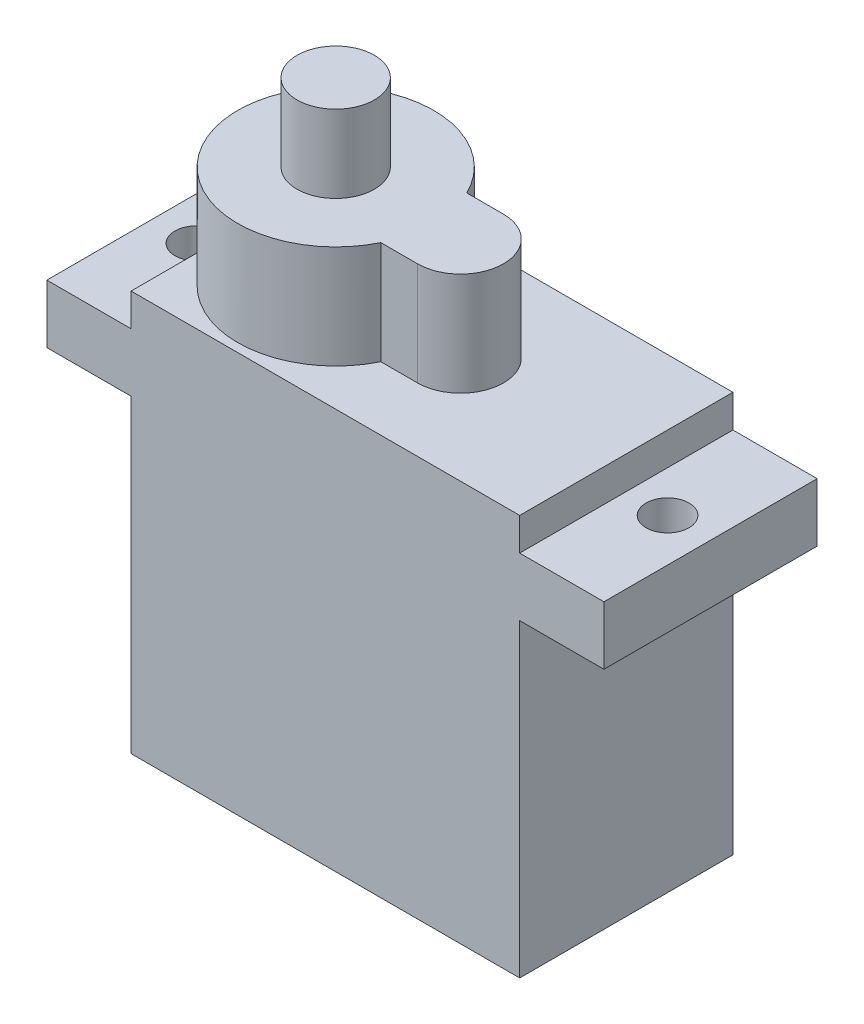
ISO-10303-21;
HEADER;
FILE_DESCRIPTION(('STEP AP214'),'2;1');
FILE_NAME('part.step','',(''),(''),'','','');
FILE_SCHEMA(('AUTOMOTIVE_DESIGN { 1 0 10303 214 1 1 1 1 }'));
ENDSEC;
DATA;
#1=APPLICATION_CONTEXT('core data for automotive mechanical design processes');
#2=APPLICATION_PROTOCOL_DEFINITION('international standard','automotive_design',2000,#1);
#3=PRODUCT_CONTEXT('',#1,'mechanical');
#4=PRODUCT('Part','Part','',(#3));
#5=PRODUCT_RELATED_PRODUCT_CATEGORY('part','',(#4));
#6=PRODUCT_DEFINITION_FORMATION('','',#4);
#7=PRODUCT_DEFINITION_CONTEXT('part definition',#1,'design');
#8=PRODUCT_DEFINITION('design','',#6,#7);
#9=PRODUCT_DEFINITION_SHAPE('','',#8);
#10=(LENGTH_UNIT() NAMED_UNIT(*) SI_UNIT(.MILLI.,.METRE.));
#11=(NAMED_UNIT(*) PLANE_ANGLE_UNIT() SI_UNIT($,.RADIAN.));
#12=(NAMED_UNIT(*) SI_UNIT($,.STERADIAN.) SOLID_ANGLE_UNIT());
#13=UNCERTAINTY_MEASURE_WITH_UNIT(LENGTH_MEASURE(1.E-05),#10,'distance_accuracy_value','');
#14=(GEOMETRIC_REPRESENTATION_CONTEXT(3) GLOBAL_UNCERTAINTY_ASSIGNED_CONTEXT((#13)) GLOBAL_UNIT_ASSIGNED_CONTEXT((#10,
#11,#12)) REPRESENTATION_CONTEXT('',''));
#15=CARTESIAN_POINT('',(0.,0.,0.));
#16=DIRECTION('',(0.,0.,1.));
#17=DIRECTION('',(1.,0.,0.));
#18=AXIS2_PLACEMENT_3D('',#15,#16,#17);
#19=CARTESIAN_POINT('',(-5.6,29.3,0.));
#20=DIRECTION('',(0.,1.,0.));
#21=DIRECTION('',(0.,0.,1.));
#22=AXIS2_PLACEMENT_3D('',#19,#20,#21);
#23=PLANE('',#22);
#24=CARTESIAN_POINT('',(-5.6,29.3,0.));
#25=DIRECTION('',(0.,1.,0.));
#26=DIRECTION('',(0.,0.,1.));
#27=AXIS2_PLACEMENT_3D('',#24,#25,#26);
#28=CIRCLE('',#27,5.7);
#29=CARTESIAN_POINT('',(-0.477500610053719,29.3,-2.5));
#30=VERTEX_POINT('',#29);
#31=CARTESIAN_POINT('',(-0.477500610053719,29.3,2.5));
#32=VERTEX_POINT('',#31);
#33=EDGE_CURVE('E164',#30,#32,#28,.T.);
#34=ORIENTED_EDGE('',*,*,#33,.T.);
#35=DIRECTION('',(1.,0.,0.));
#36=VECTOR('',#35,1.);
#37=CARTESIAN_POINT('',(-0.477500610053719,29.3,2.5));
#38=LINE('',#37,#36);
#39=CARTESIAN_POINT('',(1.6594851256093,29.3,2.5));
#40=VERTEX_POINT('',#39);
#41=EDGE_CURVE('E153',#32,#40,#38,.T.);
#42=ORIENTED_EDGE('',*,*,#41,.T.);
#43=CARTESIAN_POINT('',(1.6594851256093,29.3,0.));
#44=DIRECTION('',(0.,1.,0.));
#45=DIRECTION('',(0.,0.,1.));
#46=AXIS2_PLACEMENT_3D('',#43,#44,#45);
#47=CIRCLE('',#46,2.5);
#48=CARTESIAN_POINT('',(1.6594851256093,29.3,-2.5));
#49=VERTEX_POINT('',#48);
#50=EDGE_CURVE('E163',#40,#49,#47,.T.);
#51=ORIENTED_EDGE('',*,*,#50,.T.);
#52=DIRECTION('',(-1.,0.,0.));
#53=VECTOR('',#52,1.);
#54=CARTESIAN_POINT('',(1.6594851256093,29.3,-2.5));
#55=LINE('',#54,#53);
#56=EDGE_CURVE('E169',#49,#30,#55,.T.);
#57=ORIENTED_EDGE('',*,*,#56,.T.);
#58=EDGE_LOOP('',(#34,#42,#51,#57));
#59=FACE_BOUND('',#58,.T.);
#60=CARTESIAN_POINT('',(-5.6,29.3,0.));
#61=DIRECTION('',(0.,1.,0.));
#62=DIRECTION('',(0.,0.,1.));
#63=AXIS2_PLACEMENT_3D('',#60,#61,#62);
#64=CIRCLE('',#63,2.25);
#65=CARTESIAN_POINT('',(-5.6,29.3,2.25));
#66=VERTEX_POINT('',#65);
#67=EDGE_CURVE('E554',#66,#66,#64,.T.);
#68=ORIENTED_EDGE('',*,*,#67,.F.);
#69=EDGE_LOOP('',(#68));
#70=FACE_BOUND('',#69,.T.);
#71=ADVANCED_FACE('F36',(#59,#70),#23,.T.);
#72=CARTESIAN_POINT('',(0.,21.4,0.));
#73=DIRECTION('',(0.,1.,0.));
#74=DIRECTION('',(0.,0.,1.));
#75=AXIS2_PLACEMENT_3D('',#72,#73,#74);
#76=PLANE('',#75);
#77=DIRECTION('',(0.,0.,-1.));
#78=VECTOR('',#77,1.);
#79=CARTESIAN_POINT('',(11.3,21.4,6.2));
#80=LINE('',#79,#78);
#81=CARTESIAN_POINT('',(11.3,21.4,6.2));
#82=VERTEX_POINT('',#81);
#83=CARTESIAN_POINT('',(11.3,21.4,-6.2));
#84=VERTEX_POINT('',#83);
#85=EDGE_CURVE('E178',#82,#84,#80,.T.);
#86=ORIENTED_EDGE('',*,*,#85,.F.);
#87=DIRECTION('',(1.,0.,0.));
#88=VECTOR('',#87,1.);
#89=CARTESIAN_POINT('',(-16.2,21.4,6.2));
#90=LINE('',#89,#88);
#91=CARTESIAN_POINT('',(16.2,21.4,6.2));
#92=VERTEX_POINT('',#91);
#93=EDGE_CURVE('E202',#82,#92,#90,.T.);
#94=ORIENTED_EDGE('',*,*,#93,.T.);
#95=DIRECTION('',(0.,0.,-1.));
#96=VECTOR('',#95,1.);
#97=CARTESIAN_POINT('',(16.2,21.4,-6.2));
#98=LINE('',#97,#96);
#99=CARTESIAN_POINT('',(16.2,21.4,-6.2));
#100=VERTEX_POINT('',#99);
#101=EDGE_CURVE('E261',#92,#100,#98,.T.);
#102=ORIENTED_EDGE('',*,*,#101,.T.);
#103=DIRECTION('',(-1.,0.,0.));
#104=VECTOR('',#103,1.);
#105=CARTESIAN_POINT('',(-16.2,21.4,-6.2));
#106=LINE('',#105,#104);
#107=EDGE_CURVE('E241',#100,#84,#106,.T.);
#108=ORIENTED_EDGE('',*,*,#107,.T.);
#109=EDGE_LOOP('',(#86,#94,#102,#108));
#110=FACE_BOUND('',#109,.T.);
#111=CARTESIAN_POINT('',(13.7,21.4,0.));
#112=DIRECTION('',(0.,1.,0.));
#113=DIRECTION('',(0.,0.,-1.));
#114=AXIS2_PLACEMENT_3D('',#111,#112,#113);
#115=CIRCLE('',#114,1.25);
#116=CARTESIAN_POINT('',(13.7,21.4,-1.25));
#117=VERTEX_POINT('',#116);
#118=EDGE_CURVE('E374',#117,#117,#115,.T.);
#119=ORIENTED_EDGE('',*,*,#118,.F.);
#120=EDGE_LOOP('',(#119));
#121=FACE_BOUND('',#120,.T.);
#122=ADVANCED_FACE('F379',(#110,#121),#76,.T.);
#123=CARTESIAN_POINT('',(11.3,18.,-6.2));
#124=DIRECTION('',(-1.,0.,0.));
#125=DIRECTION('',(0.,0.,1.));
#126=AXIS2_PLACEMENT_3D('',#123,#124,#125);
#127=PLANE('',#126);
#128=DIRECTION('',(0.,0.,-1.));
#129=VECTOR('',#128,1.);
#130=CARTESIAN_POINT('',(11.3,0.,-6.2));
#131=LINE('',#130,#129);
#132=CARTESIAN_POINT('',(11.3,0.,6.2));
#133=VERTEX_POINT('',#132);
#134=CARTESIAN_POINT('',(11.3,0.,-6.2));
#135=VERTEX_POINT('',#134);
#136=EDGE_CURVE('E289',#133,#135,#131,.T.);
#137=ORIENTED_EDGE('',*,*,#136,.T.);
#138=DIRECTION('',(0.,-1.,0.));
#139=VECTOR('',#138,1.);
#140=CARTESIAN_POINT('',(11.3,18.,-6.2));
#141=LINE('',#140,#139);
#142=CARTESIAN_POINT('',(11.3,18.,-6.2));
#143=VERTEX_POINT('',#142);
#144=EDGE_CURVE('E45',#143,#135,#141,.T.);
#145=ORIENTED_EDGE('',*,*,#144,.F.);
#146=DIRECTION('',(0.,0.,-1.));
#147=VECTOR('',#146,1.);
#148=CARTESIAN_POINT('',(11.3,18.,-6.2));
#149=LINE('',#148,#147);
#150=CARTESIAN_POINT('',(11.3,18.,6.2));
#151=VERTEX_POINT('',#150);
#152=EDGE_CURVE('E275',#151,#143,#149,.T.);
#153=ORIENTED_EDGE('',*,*,#152,.F.);
#154=DIRECTION('',(0.,-1.,0.));
#155=VECTOR('',#154,1.);
#156=CARTESIAN_POINT('',(11.3,18.,6.2));
#157=LINE('',#156,#155);
#158=EDGE_CURVE('E265',#151,#133,#157,.T.);
#159=ORIENTED_EDGE('',*,*,#158,.T.);
#160=EDGE_LOOP('',(#137,#145,#153,#159));
#161=FACE_BOUND('',#160,.T.);
#162=ADVANCED_FACE('F38',(#161),#127,.F.);
#163=CARTESIAN_POINT('',(-11.3,18.,-6.2));
#164=DIRECTION('',(0.,0.,1.));
#165=DIRECTION('',(1.,0.,0.));
#166=AXIS2_PLACEMENT_3D('',#163,#164,#165);
#167=PLANE('',#166);
#168=DIRECTION('',(-1.,0.,0.));
#169=VECTOR('',#168,1.);
#170=CARTESIAN_POINT('',(-11.3,0.,-6.2));
#171=LINE('',#170,#169);
#172=CARTESIAN_POINT('',(-11.3,0.,-6.2));
#173=VERTEX_POINT('',#172);
#174=EDGE_CURVE('E310',#135,#173,#171,.T.);
#175=ORIENTED_EDGE('',*,*,#174,.T.);
#176=DIRECTION('',(0.,-1.,0.));
#177=VECTOR('',#176,1.);
#178=CARTESIAN_POINT('',(-11.3,18.,-6.2));
#179=LINE('',#178,#177);
#180=CARTESIAN_POINT('',(-11.3,18.,-6.2));
#181=VERTEX_POINT('',#180);
#182=EDGE_CURVE('E274',#181,#173,#179,.T.);
#183=ORIENTED_EDGE('',*,*,#182,.F.);
#184=DIRECTION('',(-1.,0.,0.));
#185=VECTOR('',#184,1.);
#186=CARTESIAN_POINT('',(-16.2,18.,-6.2));
#187=LINE('',#186,#185);
#188=CARTESIAN_POINT('',(-16.2,18.,-6.2));
#189=VERTEX_POINT('',#188);
#190=EDGE_CURVE('E285',#181,#189,#187,.T.);
#191=ORIENTED_EDGE('',*,*,#190,.T.);
#192=DIRECTION('',(0.,-1.,0.));
#193=VECTOR('',#192,1.);
#194=CARTESIAN_POINT('',(-16.2,21.4,-6.2));
#195=LINE('',#194,#193);
#196=CARTESIAN_POINT('',(-16.2,21.4,-6.2));
#197=VERTEX_POINT('',#196);
#198=EDGE_CURVE('E317',#197,#189,#195,.T.);
#199=ORIENTED_EDGE('',*,*,#198,.F.);
#200=CARTESIAN_POINT('',(-11.3,21.4,-6.2));
#201=VERTEX_POINT('',#200);
#202=EDGE_CURVE('E249',#201,#197,#106,.T.);
#203=ORIENTED_EDGE('',*,*,#202,.F.);
#204=DIRECTION('',(0.,-1.,0.));
#205=VECTOR('',#204,1.);
#206=CARTESIAN_POINT('',(-11.3,23.3,-6.2));
#207=LINE('',#206,#205);
#208=CARTESIAN_POINT('',(-11.3,23.3,-6.2));
#209=VERTEX_POINT('',#208);
#210=EDGE_CURVE('E208',#209,#201,#207,.T.);
#211=ORIENTED_EDGE('',*,*,#210,.F.);
#212=DIRECTION('',(-1.,0.,0.));
#213=VECTOR('',#212,1.);
#214=CARTESIAN_POINT('',(11.3,23.3,-6.2));
#215=LINE('',#214,#213);
#216=CARTESIAN_POINT('',(11.3,23.3,-6.2));
#217=VERTEX_POINT('',#216);
#218=EDGE_CURVE('E184',#217,#209,#215,.T.);
#219=ORIENTED_EDGE('',*,*,#218,.F.);
#220=DIRECTION('',(0.,-1.,0.));
#221=VECTOR('',#220,1.);
#222=CARTESIAN_POINT('',(11.3,23.3,-6.2));
#223=LINE('',#222,#221);
#224=EDGE_CURVE('E195',#217,#84,#223,.T.);
#225=ORIENTED_EDGE('',*,*,#224,.T.);
#226=ORIENTED_EDGE('',*,*,#107,.F.);
#227=DIRECTION('',(0.,-1.,0.));
#228=VECTOR('',#227,1.);
#229=CARTESIAN_POINT('',(16.2,21.4,-6.2));
#230=LINE('',#229,#228);
#231=CARTESIAN_POINT('',(16.2,18.,-6.2));
#232=VERTEX_POINT('',#231);
#233=EDGE_CURVE('E313',#100,#232,#230,.T.);
#234=ORIENTED_EDGE('',*,*,#233,.T.);
#235=EDGE_CURVE('E354',#232,#143,#187,.T.);
#236=ORIENTED_EDGE('',*,*,#235,.T.);
#237=ORIENTED_EDGE('',*,*,#144,.T.);
#238=EDGE_LOOP('',(#175,#183,#191,#199,#203,#211,#219,#225,#226,#234,#236,#237));
#239=FACE_BOUND('',#238,.T.);
#240=ADVANCED_FACE('F447',(#239),#167,.F.);
#241=CARTESIAN_POINT('',(-11.3,18.,-6.2));
#242=DIRECTION('',(1.,0.,0.));
#243=DIRECTION('',(0.,0.,-1.));
#244=AXIS2_PLACEMENT_3D('',#241,#242,#243);
#245=PLANE('',#244);
#246=DIRECTION('',(0.,0.,1.));
#247=VECTOR('',#246,1.);
#248=CARTESIAN_POINT('',(-11.3,0.,-6.2));
#249=LINE('',#248,#247);
#250=CARTESIAN_POINT('',(-11.3,0.,6.2));
#251=VERTEX_POINT('',#250);
#252=EDGE_CURVE('E308',#173,#251,#249,.T.);
#253=ORIENTED_EDGE('',*,*,#252,.T.);
#254=DIRECTION('',(0.,-1.,0.));
#255=VECTOR('',#254,1.);
#256=CARTESIAN_POINT('',(-11.3,18.,6.2));
#257=LINE('',#256,#255);
#258=CARTESIAN_POINT('',(-11.3,18.,6.2));
#259=VERTEX_POINT('',#258);
#260=EDGE_CURVE('E268',#259,#251,#257,.T.);
#261=ORIENTED_EDGE('',*,*,#260,.F.);
#262=DIRECTION('',(0.,0.,1.));
#263=VECTOR('',#262,1.);
#264=CARTESIAN_POINT('',(-11.3,18.,-6.2));
#265=LINE('',#264,#263);
#266=EDGE_CURVE('E269',#181,#259,#265,.T.);
#267=ORIENTED_EDGE('',*,*,#266,.F.);
#268=ORIENTED_EDGE('',*,*,#182,.T.);
#269=EDGE_LOOP('',(#253,#261,#267,#268));
#270=FACE_BOUND('',#269,.T.);
#271=ADVANCED_FACE('F345',(#270),#245,.F.);
#272=CARTESIAN_POINT('',(-11.3,18.,6.2));
#273=DIRECTION('',(0.,0.,-1.));
#274=DIRECTION('',(-1.,0.,0.));
#275=AXIS2_PLACEMENT_3D('',#272,#273,#274);
#276=PLANE('',#275);
#277=DIRECTION('',(1.,0.,0.));
#278=VECTOR('',#277,1.);
#279=CARTESIAN_POINT('',(-11.3,0.,6.2));
#280=LINE('',#279,#278);
#281=EDGE_CURVE('E279',#251,#133,#280,.T.);
#282=ORIENTED_EDGE('',*,*,#281,.T.);
#283=ORIENTED_EDGE('',*,*,#158,.F.);
#284=DIRECTION('',(1.,0.,0.));
#285=VECTOR('',#284,1.);
#286=CARTESIAN_POINT('',(-16.2,18.,6.2));
#287=LINE('',#286,#285);
#288=CARTESIAN_POINT('',(16.2,18.,6.2));
#289=VERTEX_POINT('',#288);
#290=EDGE_CURVE('E331',#151,#289,#287,.T.);
#291=ORIENTED_EDGE('',*,*,#290,.T.);
#292=DIRECTION('',(0.,-1.,0.));
#293=VECTOR('',#292,1.);
#294=CARTESIAN_POINT('',(16.2,21.4,6.2));
#295=LINE('',#294,#293);
#296=EDGE_CURVE('E234',#92,#289,#295,.T.);
#297=ORIENTED_EDGE('',*,*,#296,.F.);
#298=ORIENTED_EDGE('',*,*,#93,.F.);
#299=DIRECTION('',(0.,-1.,0.));
#300=VECTOR('',#299,1.);
#301=CARTESIAN_POINT('',(11.3,23.3,6.2));
#302=LINE('',#301,#300);
#303=CARTESIAN_POINT('',(11.3,23.3,6.2));
#304=VERTEX_POINT('',#303);
#305=EDGE_CURVE('E209',#304,#82,#302,.T.);
#306=ORIENTED_EDGE('',*,*,#305,.F.);
#307=DIRECTION('',(1.,0.,0.));
#308=VECTOR('',#307,1.);
#309=CARTESIAN_POINT('',(-11.3,23.3,6.2));
#310=LINE('',#309,#308);
#311=CARTESIAN_POINT('',(-11.3,23.3,6.2));
#312=VERTEX_POINT('',#311);
#313=EDGE_CURVE('E191',#312,#304,#310,.T.);
#314=ORIENTED_EDGE('',*,*,#313,.F.);
#315=DIRECTION('',(0.,-1.,0.));
#316=VECTOR('',#315,1.);
#317=CARTESIAN_POINT('',(-11.3,23.3,6.2));
#318=LINE('',#317,#316);
#319=CARTESIAN_POINT('',(-11.3,21.4,6.2));
#320=VERTEX_POINT('',#319);
#321=EDGE_CURVE('E205',#312,#320,#318,.T.);
#322=ORIENTED_EDGE('',*,*,#321,.T.);
#323=CARTESIAN_POINT('',(-16.2,21.4,6.2));
#324=VERTEX_POINT('',#323);
#325=EDGE_CURVE('E238',#324,#320,#90,.T.);
#326=ORIENTED_EDGE('',*,*,#325,.F.);
#327=DIRECTION('',(0.,-1.,0.));
#328=VECTOR('',#327,1.);
#329=CARTESIAN_POINT('',(-16.2,21.4,6.2));
#330=LINE('',#329,#328);
#331=CARTESIAN_POINT('',(-16.2,18.,6.2));
#332=VERTEX_POINT('',#331);
#333=EDGE_CURVE('E324',#324,#332,#330,.T.);
#334=ORIENTED_EDGE('',*,*,#333,.T.);
#335=EDGE_CURVE('E328',#332,#259,#287,.T.);
#336=ORIENTED_EDGE('',*,*,#335,.T.);
#337=ORIENTED_EDGE('',*,*,#260,.T.);
#338=EDGE_LOOP('',(#282,#283,#291,#297,#298,#306,#314,#322,#326,#334,#336,#337));
#339=FACE_BOUND('',#338,.T.);
#340=ADVANCED_FACE('F231',(#339),#276,.F.);
#341=CARTESIAN_POINT('',(0.,0.,0.));
#342=DIRECTION('',(0.,1.,0.));
#343=DIRECTION('',(0.,0.,1.));
#344=AXIS2_PLACEMENT_3D('',#341,#342,#343);
#345=PLANE('',#344);
#346=ORIENTED_EDGE('',*,*,#136,.F.);
#347=ORIENTED_EDGE('',*,*,#281,.F.);
#348=ORIENTED_EDGE('',*,*,#252,.F.);
#349=ORIENTED_EDGE('',*,*,#174,.F.);
#350=EDGE_LOOP('',(#346,#347,#348,#349));
#351=FACE_BOUND('',#350,.T.);
#352=ADVANCED_FACE('F347',(#351),#345,.F.);
#353=CARTESIAN_POINT('',(0.,18.,0.));
#354=DIRECTION('',(0.,1.,0.));
#355=DIRECTION('',(0.,0.,1.));
#356=AXIS2_PLACEMENT_3D('',#353,#354,#355);
#357=PLANE('',#356);
#358=CARTESIAN_POINT('',(13.7,18.,0.));
#359=DIRECTION('',(0.,1.,0.));
#360=DIRECTION('',(0.,0.,-1.));
#361=AXIS2_PLACEMENT_3D('',#358,#359,#360);
#362=CIRCLE('',#361,1.25);
#363=CARTESIAN_POINT('',(13.7,18.,-1.25));
#364=VERTEX_POINT('',#363);
#365=EDGE_CURVE('E214',#364,#364,#362,.T.);
#366=ORIENTED_EDGE('',*,*,#365,.T.);
#367=EDGE_LOOP('',(#366));
#368=FACE_BOUND('',#367,.T.);
#369=ORIENTED_EDGE('',*,*,#290,.F.);
#370=ORIENTED_EDGE('',*,*,#152,.T.);
#371=ORIENTED_EDGE('',*,*,#235,.F.);
#372=DIRECTION('',(0.,0.,-1.));
#373=VECTOR('',#372,1.);
#374=CARTESIAN_POINT('',(16.2,18.,-6.2));
#375=LINE('',#374,#373);
#376=EDGE_CURVE('E256',#289,#232,#375,.T.);
#377=ORIENTED_EDGE('',*,*,#376,.F.);
#378=EDGE_LOOP('',(#369,#370,#371,#377));
#379=FACE_BOUND('',#378,.T.);
#380=ADVANCED_FACE('F352',(#368,#379),#357,.F.);
#381=CARTESIAN_POINT('',(-13.7,18.,0.));
#382=DIRECTION('',(0.,1.,0.));
#383=DIRECTION('',(0.,0.,1.));
#384=AXIS2_PLACEMENT_3D('',#381,#382,#383);
#385=CIRCLE('',#384,1.25);
#386=CARTESIAN_POINT('',(-13.7,18.,1.25));
#387=VERTEX_POINT('',#386);
#388=EDGE_CURVE('E369',#387,#387,#385,.T.);
#389=ORIENTED_EDGE('',*,*,#388,.T.);
#390=EDGE_LOOP('',(#389));
#391=FACE_BOUND('',#390,.T.);
#392=ORIENTED_EDGE('',*,*,#190,.F.);
#393=ORIENTED_EDGE('',*,*,#266,.T.);
#394=ORIENTED_EDGE('',*,*,#335,.F.);
#395=DIRECTION('',(0.,0.,1.));
#396=VECTOR('',#395,1.);
#397=CARTESIAN_POINT('',(-16.2,18.,-6.2));
#398=LINE('',#397,#396);
#399=EDGE_CURVE('E335',#189,#332,#398,.T.);
#400=ORIENTED_EDGE('',*,*,#399,.F.);
#401=EDGE_LOOP('',(#392,#393,#394,#400));
#402=FACE_BOUND('',#401,.T.);
#403=ADVANCED_FACE('F344',(#391,#402),#357,.F.);
#404=DIRECTION('',(0.,0.,1.));
#405=VECTOR('',#404,1.);
#406=CARTESIAN_POINT('',(-11.3,21.4,-6.2));
#407=LINE('',#406,#405);
#408=EDGE_CURVE('E175',#201,#320,#407,.T.);
#409=ORIENTED_EDGE('',*,*,#408,.F.);
#410=ORIENTED_EDGE('',*,*,#202,.T.);
#411=DIRECTION('',(0.,0.,1.));
#412=VECTOR('',#411,1.);
#413=CARTESIAN_POINT('',(-16.2,21.4,-6.2));
#414=LINE('',#413,#412);
#415=EDGE_CURVE('E239',#197,#324,#414,.T.);
#416=ORIENTED_EDGE('',*,*,#415,.T.);
#417=ORIENTED_EDGE('',*,*,#325,.T.);
#418=EDGE_LOOP('',(#409,#410,#416,#417));
#419=FACE_BOUND('',#418,.T.);
#420=CARTESIAN_POINT('',(-13.7,21.4,0.));
#421=DIRECTION('',(0.,1.,0.));
#422=DIRECTION('',(0.,0.,1.));
#423=AXIS2_PLACEMENT_3D('',#420,#421,#422);
#424=CIRCLE('',#423,1.25);
#425=CARTESIAN_POINT('',(-13.7,21.4,1.25));
#426=VERTEX_POINT('',#425);
#427=EDGE_CURVE('E364',#426,#426,#424,.T.);
#428=ORIENTED_EDGE('',*,*,#427,.F.);
#429=EDGE_LOOP('',(#428));
#430=FACE_BOUND('',#429,.T.);
#431=ADVANCED_FACE('F384',(#419,#430),#76,.T.);
#432=CARTESIAN_POINT('',(16.2,21.4,-6.2));
#433=DIRECTION('',(-1.,0.,0.));
#434=DIRECTION('',(0.,0.,1.));
#435=AXIS2_PLACEMENT_3D('',#432,#433,#434);
#436=PLANE('',#435);
#437=ORIENTED_EDGE('',*,*,#376,.T.);
#438=ORIENTED_EDGE('',*,*,#233,.F.);
#439=ORIENTED_EDGE('',*,*,#101,.F.);
#440=ORIENTED_EDGE('',*,*,#296,.T.);
#441=EDGE_LOOP('',(#437,#438,#439,#440));
#442=FACE_BOUND('',#441,.T.);
#443=ADVANCED_FACE('F381',(#442),#436,.F.);
#444=CARTESIAN_POINT('',(-16.2,21.4,-6.2));
#445=DIRECTION('',(1.,0.,0.));
#446=DIRECTION('',(0.,0.,-1.));
#447=AXIS2_PLACEMENT_3D('',#444,#445,#446);
#448=PLANE('',#447);
#449=ORIENTED_EDGE('',*,*,#399,.T.);
#450=ORIENTED_EDGE('',*,*,#333,.F.);
#451=ORIENTED_EDGE('',*,*,#415,.F.);
#452=ORIENTED_EDGE('',*,*,#198,.T.);
#453=EDGE_LOOP('',(#449,#450,#451,#452));
#454=FACE_BOUND('',#453,.T.);
#455=ADVANCED_FACE('F383',(#454),#448,.F.);
#456=CARTESIAN_POINT('',(-13.7,21.4,0.));
#457=DIRECTION('',(0.,-1.,0.));
#458=DIRECTION('',(0.,0.,-1.));
#459=AXIS2_PLACEMENT_3D('',#456,#457,#458);
#460=CYLINDRICAL_SURFACE('',#459,1.25);
#461=ORIENTED_EDGE('',*,*,#427,.T.);
#462=EDGE_LOOP('',(#461));
#463=FACE_BOUND('',#462,.T.);
#464=ORIENTED_EDGE('',*,*,#388,.F.);
#465=EDGE_LOOP('',(#464));
#466=FACE_BOUND('',#465,.T.);
#467=ADVANCED_FACE('F390',(#463,#466),#460,.F.);
#468=CARTESIAN_POINT('',(13.7,21.4,0.));
#469=DIRECTION('',(0.,-1.,0.));
#470=DIRECTION('',(0.,0.,-1.));
#471=AXIS2_PLACEMENT_3D('',#468,#469,#470);
#472=CYLINDRICAL_SURFACE('',#471,1.25);
#473=ORIENTED_EDGE('',*,*,#118,.T.);
#474=EDGE_LOOP('',(#473));
#475=FACE_BOUND('',#474,.T.);
#476=ORIENTED_EDGE('',*,*,#365,.F.);
#477=EDGE_LOOP('',(#476));
#478=FACE_BOUND('',#477,.T.);
#479=ADVANCED_FACE('F423',(#475,#478),#472,.F.);
#480=CARTESIAN_POINT('',(-11.3,23.3,-6.2));
#481=DIRECTION('',(1.,0.,0.));
#482=DIRECTION('',(0.,0.,-1.));
#483=AXIS2_PLACEMENT_3D('',#480,#481,#482);
#484=PLANE('',#483);
#485=ORIENTED_EDGE('',*,*,#408,.T.);
#486=ORIENTED_EDGE('',*,*,#321,.F.);
#487=DIRECTION('',(0.,0.,1.));
#488=VECTOR('',#487,1.);
#489=CARTESIAN_POINT('',(-11.3,23.3,-6.2));
#490=LINE('',#489,#488);
#491=CARTESIAN_POINT('',(-11.3,23.3,0.));
#492=VERTEX_POINT('',#491);
#493=EDGE_CURVE('E188',#492,#312,#490,.T.);
#494=ORIENTED_EDGE('',*,*,#493,.F.);
#495=EDGE_CURVE('E189',#209,#492,#490,.T.);
#496=ORIENTED_EDGE('',*,*,#495,.F.);
#497=ORIENTED_EDGE('',*,*,#210,.T.);
#498=EDGE_LOOP('',(#485,#486,#494,#496,#497));
#499=FACE_BOUND('',#498,.T.);
#500=ADVANCED_FACE('F420',(#499),#484,.F.);
#501=CARTESIAN_POINT('',(11.3,23.3,6.2));
#502=DIRECTION('',(-1.,0.,0.));
#503=DIRECTION('',(0.,0.,1.));
#504=AXIS2_PLACEMENT_3D('',#501,#502,#503);
#505=PLANE('',#504);
#506=ORIENTED_EDGE('',*,*,#85,.T.);
#507=ORIENTED_EDGE('',*,*,#224,.F.);
#508=DIRECTION('',(0.,0.,-1.));
#509=VECTOR('',#508,1.);
#510=CARTESIAN_POINT('',(11.3,23.3,6.2));
#511=LINE('',#510,#509);
#512=EDGE_CURVE('E193',#304,#217,#511,.T.);
#513=ORIENTED_EDGE('',*,*,#512,.F.);
#514=ORIENTED_EDGE('',*,*,#305,.T.);
#515=EDGE_LOOP('',(#506,#507,#513,#514));
#516=FACE_BOUND('',#515,.T.);
#517=ADVANCED_FACE('F226',(#516),#505,.F.);
#518=CARTESIAN_POINT('',(0.,23.3,0.));
#519=DIRECTION('',(0.,1.,0.));
#520=DIRECTION('',(0.,0.,1.));
#521=AXIS2_PLACEMENT_3D('',#518,#519,#520);
#522=PLANE('',#521);
#523=CARTESIAN_POINT('',(-5.6,23.3,0.));
#524=DIRECTION('',(0.,1.,0.));
#525=DIRECTION('',(0.,0.,1.));
#526=AXIS2_PLACEMENT_3D('',#523,#524,#525);
#527=CIRCLE('',#526,5.7);
#528=CARTESIAN_POINT('',(-0.477500610053719,23.3,-2.5));
#529=VERTEX_POINT('',#528);
#530=EDGE_CURVE('E47',#529,#492,#527,.T.);
#531=ORIENTED_EDGE('',*,*,#530,.F.);
#532=DIRECTION('',(-1.,0.,0.));
#533=VECTOR('',#532,1.);
#534=CARTESIAN_POINT('',(1.6594851256093,23.3,-2.5));
#535=LINE('',#534,#533);
#536=CARTESIAN_POINT('',(1.6594851256093,23.3,-2.5));
#537=VERTEX_POINT('',#536);
#538=EDGE_CURVE('E57',#537,#529,#535,.T.);
#539=ORIENTED_EDGE('',*,*,#538,.F.);
#540=CARTESIAN_POINT('',(1.6594851256093,23.3,0.));
#541=DIRECTION('',(0.,1.,0.));
#542=DIRECTION('',(0.,0.,1.));
#543=AXIS2_PLACEMENT_3D('',#540,#541,#542);
#544=CIRCLE('',#543,2.5);
#545=CARTESIAN_POINT('',(1.6594851256093,23.3,2.5));
#546=VERTEX_POINT('',#545);
#547=EDGE_CURVE('E564',#546,#537,#544,.T.);
#548=ORIENTED_EDGE('',*,*,#547,.F.);
#549=DIRECTION('',(1.,0.,0.));
#550=VECTOR('',#549,1.);
#551=CARTESIAN_POINT('',(-0.477500610053719,23.3,2.5));
#552=LINE('',#551,#550);
#553=CARTESIAN_POINT('',(-0.477500610053719,23.3,2.5));
#554=VERTEX_POINT('',#553);
#555=EDGE_CURVE('E556',#554,#546,#552,.T.);
#556=ORIENTED_EDGE('',*,*,#555,.F.);
#557=EDGE_CURVE('E11',#492,#554,#527,.T.);
#558=ORIENTED_EDGE('',*,*,#557,.F.);
#559=ORIENTED_EDGE('',*,*,#493,.T.);
#560=ORIENTED_EDGE('',*,*,#313,.T.);
#561=ORIENTED_EDGE('',*,*,#512,.T.);
#562=ORIENTED_EDGE('',*,*,#218,.T.);
#563=ORIENTED_EDGE('',*,*,#495,.T.);
#564=EDGE_LOOP('',(#531,#539,#548,#556,#558,#559,#560,#561,#562,#563));
#565=FACE_BOUND('',#564,.T.);
#566=ADVANCED_FACE('F415',(#565),#522,.T.);
#567=CARTESIAN_POINT('',(-5.6,29.3,0.));
#568=DIRECTION('',(0.,-1.,0.));
#569=DIRECTION('',(0.,0.,-1.));
#570=AXIS2_PLACEMENT_3D('',#567,#568,#569);
#571=CYLINDRICAL_SURFACE('',#570,5.7);
#572=ORIENTED_EDGE('',*,*,#530,.T.);
#573=ORIENTED_EDGE('',*,*,#557,.T.);
#574=DIRECTION('',(0.,-1.,0.));
#575=VECTOR('',#574,1.);
#576=CARTESIAN_POINT('',(-0.477500610053719,29.3,2.5));
#577=LINE('',#576,#575);
#578=EDGE_CURVE('E158',#32,#554,#577,.T.);
#579=ORIENTED_EDGE('',*,*,#578,.F.);
#580=ORIENTED_EDGE('',*,*,#33,.F.);
#581=DIRECTION('',(0.,-1.,0.));
#582=VECTOR('',#581,1.);
#583=CARTESIAN_POINT('',(-0.477500610053719,29.3,-2.5));
#584=LINE('',#583,#582);
#585=EDGE_CURVE('E561',#30,#529,#584,.T.);
#586=ORIENTED_EDGE('',*,*,#585,.T.);
#587=EDGE_LOOP('',(#572,#573,#579,#580,#586));
#588=FACE_BOUND('',#587,.T.);
#589=ADVANCED_FACE('F174',(#588),#571,.T.);
#590=CARTESIAN_POINT('',(-0.477500610053719,29.3,2.5));
#591=DIRECTION('',(0.,0.,-1.));
#592=DIRECTION('',(-1.,0.,0.));
#593=AXIS2_PLACEMENT_3D('',#590,#591,#592);
#594=PLANE('',#593);
#595=ORIENTED_EDGE('',*,*,#555,.T.);
#596=DIRECTION('',(0.,-1.,0.));
#597=VECTOR('',#596,1.);
#598=CARTESIAN_POINT('',(1.6594851256093,29.3,2.5));
#599=LINE('',#598,#597);
#600=EDGE_CURVE('E160',#40,#546,#599,.T.);
#601=ORIENTED_EDGE('',*,*,#600,.F.);
#602=ORIENTED_EDGE('',*,*,#41,.F.);
#603=ORIENTED_EDGE('',*,*,#578,.T.);
#604=EDGE_LOOP('',(#595,#601,#602,#603));
#605=FACE_BOUND('',#604,.T.);
#606=ADVANCED_FACE('F156',(#605),#594,.F.);
#607=CARTESIAN_POINT('',(1.6594851256093,29.3,0.));
#608=DIRECTION('',(0.,-1.,0.));
#609=DIRECTION('',(0.,0.,-1.));
#610=AXIS2_PLACEMENT_3D('',#607,#608,#609);
#611=CYLINDRICAL_SURFACE('',#610,2.5);
#612=ORIENTED_EDGE('',*,*,#547,.T.);
#613=DIRECTION('',(0.,-1.,0.));
#614=VECTOR('',#613,1.);
#615=CARTESIAN_POINT('',(1.6594851256093,29.3,-2.5));
#616=LINE('',#615,#614);
#617=EDGE_CURVE('E180',#49,#537,#616,.T.);
#618=ORIENTED_EDGE('',*,*,#617,.F.);
#619=ORIENTED_EDGE('',*,*,#50,.F.);
#620=ORIENTED_EDGE('',*,*,#600,.T.);
#621=EDGE_LOOP('',(#612,#618,#619,#620));
#622=FACE_BOUND('',#621,.T.);
#623=ADVANCED_FACE('F406',(#622),#611,.T.);
#624=CARTESIAN_POINT('',(1.6594851256093,29.3,-2.5));
#625=DIRECTION('',(0.,0.,1.));
#626=DIRECTION('',(1.,0.,0.));
#627=AXIS2_PLACEMENT_3D('',#624,#625,#626);
#628=PLANE('',#627);
#629=ORIENTED_EDGE('',*,*,#538,.T.);
#630=ORIENTED_EDGE('',*,*,#585,.F.);
#631=ORIENTED_EDGE('',*,*,#56,.F.);
#632=ORIENTED_EDGE('',*,*,#617,.T.);
#633=EDGE_LOOP('',(#629,#630,#631,#632));
#634=FACE_BOUND('',#633,.T.);
#635=ADVANCED_FACE('F403',(#634),#628,.F.);
#636=CARTESIAN_POINT('',(-5.6,33.8,0.));
#637=DIRECTION('',(0.,-1.,0.));
#638=DIRECTION('',(0.,0.,-1.));
#639=AXIS2_PLACEMENT_3D('',#636,#637,#638);
#640=CYLINDRICAL_SURFACE('',#639,2.25);
#641=CARTESIAN_POINT('',(-5.6,33.8,0.));
#642=DIRECTION('',(0.,1.,0.));
#643=DIRECTION('',(0.,0.,1.));
#644=AXIS2_PLACEMENT_3D('',#641,#642,#643);
#645=CIRCLE('',#644,2.25);
#646=CARTESIAN_POINT('',(-5.6,33.8,2.25));
#647=VERTEX_POINT('',#646);
#648=EDGE_CURVE('E553',#647,#647,#645,.T.);
#649=ORIENTED_EDGE('',*,*,#648,.F.);
#650=EDGE_LOOP('',(#649));
#651=FACE_BOUND('',#650,.T.);
#652=ORIENTED_EDGE('',*,*,#67,.T.);
#653=EDGE_LOOP('',(#652));
#654=FACE_BOUND('',#653,.T.);
#655=ADVANCED_FACE('F401',(#651,#654),#640,.T.);
#656=CARTESIAN_POINT('',(-5.6,33.8,0.));
#657=DIRECTION('',(0.,1.,0.));
#658=DIRECTION('',(0.,0.,1.));
#659=AXIS2_PLACEMENT_3D('',#656,#657,#658);
#660=PLANE('',#659);
#661=ORIENTED_EDGE('',*,*,#648,.T.);
#662=EDGE_LOOP('',(#661));
#663=FACE_BOUND('',#662,.T.);
#664=ADVANCED_FACE('F539',(#663),#660,.T.);
#665=CLOSED_SHELL('',(#71,#122,#162,#240,#271,#340,#352,#380,#403,#431,#443,#455,#467,#479,#500,
#517,#566,#589,#606,#623,#635,#655,#664));
#666=MANIFOLD_SOLID_BREP('B2',#665);
#667=ADVANCED_BREP_SHAPE_REPRESENTATION('',(#18,#666),#14);
#668=SHAPE_DEFINITION_REPRESENTATION(#9,#667);
ENDSEC;
END-ISO-10303-21;
